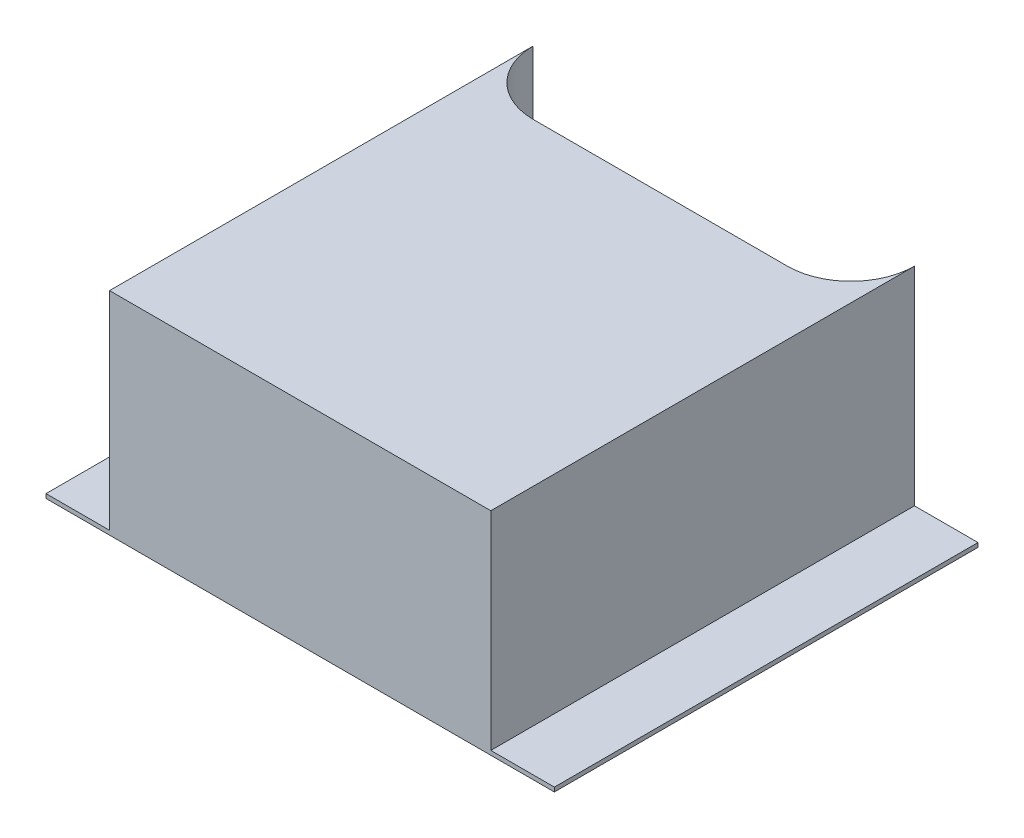
ISO-10303-21;
HEADER;
FILE_DESCRIPTION(('STEP AP214'),'2;1');
FILE_NAME('part.step','',(''),(''),'','','');
FILE_SCHEMA(('AUTOMOTIVE_DESIGN { 1 0 10303 214 1 1 1 1 }'));
ENDSEC;
DATA;
#1=APPLICATION_CONTEXT('core data for automotive mechanical design processes');
#2=APPLICATION_PROTOCOL_DEFINITION('international standard','automotive_design',2000,#1);
#3=PRODUCT_CONTEXT('',#1,'mechanical');
#4=PRODUCT('Part','Part','',(#3));
#5=PRODUCT_RELATED_PRODUCT_CATEGORY('part','',(#4));
#6=PRODUCT_DEFINITION_FORMATION('','',#4);
#7=PRODUCT_DEFINITION_CONTEXT('part definition',#1,'design');
#8=PRODUCT_DEFINITION('design','',#6,#7);
#9=PRODUCT_DEFINITION_SHAPE('','',#8);
#10=(LENGTH_UNIT() NAMED_UNIT(*) SI_UNIT(.MILLI.,.METRE.));
#11=(NAMED_UNIT(*) PLANE_ANGLE_UNIT() SI_UNIT($,.RADIAN.));
#12=(NAMED_UNIT(*) SI_UNIT($,.STERADIAN.) SOLID_ANGLE_UNIT());
#13=UNCERTAINTY_MEASURE_WITH_UNIT(LENGTH_MEASURE(1.E-05),#10,'distance_accuracy_value','');
#14=(GEOMETRIC_REPRESENTATION_CONTEXT(3) GLOBAL_UNCERTAINTY_ASSIGNED_CONTEXT((#13)) GLOBAL_UNIT_ASSIGNED_CONTEXT((#10,
#11,#12)) REPRESENTATION_CONTEXT('',''));
#15=CARTESIAN_POINT('',(0.,0.,0.));
#16=DIRECTION('',(0.,0.,1.));
#17=DIRECTION('',(1.,0.,0.));
#18=AXIS2_PLACEMENT_3D('',#15,#16,#17);
#19=CARTESIAN_POINT('',(1.72,-3.203513695928,1.6));
#20=DIRECTION('',(-1.,0.,0.));
#21=DIRECTION('',(0.,0.,1.));
#22=AXIS2_PLACEMENT_3D('',#19,#20,#21);
#23=PLANE('',#22);
#24=DIRECTION('',(0.,1.,0.));
#25=VECTOR('',#24,1.);
#26=CARTESIAN_POINT('',(1.72,-1.562049935181,-1.6));
#27=LINE('',#26,#25);
#28=CARTESIAN_POINT('',(1.72,0.01,-1.6));
#29=VERTEX_POINT('',#28);
#30=CARTESIAN_POINT('',(1.72,0.5,-1.6));
#31=VERTEX_POINT('',#30);
#32=EDGE_CURVE('E118',#29,#31,#27,.T.);
#33=ORIENTED_EDGE('',*,*,#32,.T.);
#34=DIRECTION('',(0.,0.,-1.));
#35=VECTOR('',#34,1.);
#36=CARTESIAN_POINT('',(1.72,0.5,-1.6));
#37=LINE('',#36,#35);
#38=CARTESIAN_POINT('',(1.72,0.5,-0.6));
#39=VERTEX_POINT('',#38);
#40=EDGE_CURVE('E98',#31,#39,#37,.F.);
#41=ORIENTED_EDGE('',*,*,#40,.T.);
#42=DIRECTION('',(0.,1.,0.));
#43=VECTOR('',#42,1.);
#44=CARTESIAN_POINT('',(1.72,-1.562049935181,-0.6));
#45=LINE('',#44,#43);
#46=CARTESIAN_POINT('',(1.72,0.01,-0.6));
#47=VERTEX_POINT('',#46);
#48=EDGE_CURVE('E169',#39,#47,#45,.F.);
#49=ORIENTED_EDGE('',*,*,#48,.T.);
#50=DIRECTION('',(0.,0.,1.));
#51=VECTOR('',#50,1.);
#52=CARTESIAN_POINT('',(1.72,0.01,0.));
#53=LINE('',#52,#51);
#54=EDGE_CURVE('E144',#29,#47,#53,.T.);
#55=ORIENTED_EDGE('',*,*,#54,.F.);
#56=EDGE_LOOP('',(#33,#41,#49,#55));
#57=FACE_BOUND('',#56,.T.);
#58=ADVANCED_FACE('F17',(#57),#23,.F.);
#59=CARTESIAN_POINT('',(0.,0.01,0.));
#60=DIRECTION('',(0.,1.,0.));
#61=DIRECTION('',(0.,0.,1.));
#62=AXIS2_PLACEMENT_3D('',#59,#60,#61);
#63=PLANE('',#62);
#64=DIRECTION('',(1.,0.,0.));
#65=VECTOR('',#64,1.);
#66=CARTESIAN_POINT('',(0.67,0.01,-1.6));
#67=LINE('',#66,#65);
#68=CARTESIAN_POINT('',(0.82,0.01,-1.6));
#69=VERTEX_POINT('',#68);
#70=CARTESIAN_POINT('',(0.67,0.01,-1.6));
#71=VERTEX_POINT('',#70);
#72=EDGE_CURVE('E161',#69,#71,#67,.F.);
#73=ORIENTED_EDGE('',*,*,#72,.T.);
#74=DIRECTION('',(0.,0.,-1.));
#75=VECTOR('',#74,1.);
#76=CARTESIAN_POINT('',(0.67,0.01,-0.6));
#77=LINE('',#76,#75);
#78=CARTESIAN_POINT('',(0.67,0.01,-0.6));
#79=VERTEX_POINT('',#78);
#80=EDGE_CURVE('E167',#71,#79,#77,.F.);
#81=ORIENTED_EDGE('',*,*,#80,.T.);
#82=DIRECTION('',(-1.,0.,0.));
#83=VECTOR('',#82,1.);
#84=CARTESIAN_POINT('',(1.87,0.01,-0.6));
#85=LINE('',#84,#83);
#86=CARTESIAN_POINT('',(0.82,0.01,-0.6));
#87=VERTEX_POINT('',#86);
#88=EDGE_CURVE('E200',#79,#87,#85,.F.);
#89=ORIENTED_EDGE('',*,*,#88,.T.);
#90=DIRECTION('',(0.,0.,-1.));
#91=VECTOR('',#90,1.);
#92=CARTESIAN_POINT('',(0.82,0.01,-1.6));
#93=LINE('',#92,#91);
#94=EDGE_CURVE('E158',#87,#69,#93,.T.);
#95=ORIENTED_EDGE('',*,*,#94,.T.);
#96=EDGE_LOOP('',(#73,#81,#89,#95));
#97=FACE_BOUND('',#96,.T.);
#98=ADVANCED_FACE('F258',(#97),#63,.T.);
#99=CARTESIAN_POINT('',(0.82,-3.203513695928,-1.6));
#100=DIRECTION('',(1.,0.,0.));
#101=DIRECTION('',(0.,0.,-1.));
#102=AXIS2_PLACEMENT_3D('',#99,#100,#101);
#103=PLANE('',#102);
#104=DIRECTION('',(0.,1.,0.));
#105=VECTOR('',#104,1.);
#106=CARTESIAN_POINT('',(0.82,-1.562049935181,-1.6));
#107=LINE('',#106,#105);
#108=CARTESIAN_POINT('',(0.82,0.5,-1.6));
#109=VERTEX_POINT('',#108);
#110=EDGE_CURVE('E125',#109,#69,#107,.F.);
#111=ORIENTED_EDGE('',*,*,#110,.T.);
#112=ORIENTED_EDGE('',*,*,#94,.F.);
#113=DIRECTION('',(0.,1.,0.));
#114=VECTOR('',#113,1.);
#115=CARTESIAN_POINT('',(0.82,-1.562049935181,-0.6));
#116=LINE('',#115,#114);
#117=CARTESIAN_POINT('',(0.82,0.5,-0.6));
#118=VERTEX_POINT('',#117);
#119=EDGE_CURVE('E195',#87,#118,#116,.T.);
#120=ORIENTED_EDGE('',*,*,#119,.T.);
#121=DIRECTION('',(0.,0.,-1.));
#122=VECTOR('',#121,1.);
#123=CARTESIAN_POINT('',(0.82,0.5,-1.6));
#124=LINE('',#123,#122);
#125=EDGE_CURVE('E153',#118,#109,#124,.T.);
#126=ORIENTED_EDGE('',*,*,#125,.T.);
#127=EDGE_LOOP('',(#111,#112,#120,#126));
#128=FACE_BOUND('',#127,.T.);
#129=ADVANCED_FACE('F261',(#128),#103,.F.);
#130=CARTESIAN_POINT('',(0.97,0.5,-1.6));
#131=DIRECTION('',(0.,-1.,0.));
#132=DIRECTION('',(0.,0.,-1.));
#133=AXIS2_PLACEMENT_3D('',#130,#131,#132);
#134=PLANE('',#133);
#135=ORIENTED_EDGE('',*,*,#125,.F.);
#136=DIRECTION('',(-1.,0.,0.));
#137=VECTOR('',#136,1.);
#138=CARTESIAN_POINT('',(1.87,0.5,-0.6));
#139=LINE('',#138,#137);
#140=EDGE_CURVE('E136',#118,#39,#139,.F.);
#141=ORIENTED_EDGE('',*,*,#140,.T.);
#142=ORIENTED_EDGE('',*,*,#40,.F.);
#143=CARTESIAN_POINT('',(1.57,0.5,-1.6));
#144=DIRECTION('',(0.,1.,0.));
#145=DIRECTION('',(0.,0.,1.));
#146=AXIS2_PLACEMENT_3D('',#143,#144,#145);
#147=CIRCLE('',#146,0.15);
#148=CARTESIAN_POINT('',(1.57,0.5,-1.45));
#149=VERTEX_POINT('',#148);
#150=EDGE_CURVE('E20',#31,#149,#147,.F.);
#151=ORIENTED_EDGE('',*,*,#150,.T.);
#152=DIRECTION('',(1.,0.,0.));
#153=VECTOR('',#152,1.);
#154=CARTESIAN_POINT('',(0.97,0.5,-1.45));
#155=LINE('',#154,#153);
#156=CARTESIAN_POINT('',(0.97,0.5,-1.45));
#157=VERTEX_POINT('',#156);
#158=EDGE_CURVE('E104',#149,#157,#155,.F.);
#159=ORIENTED_EDGE('',*,*,#158,.T.);
#160=CARTESIAN_POINT('',(0.97,0.5,-1.6));
#161=DIRECTION('',(0.,1.,0.));
#162=DIRECTION('',(0.,0.,1.));
#163=AXIS2_PLACEMENT_3D('',#160,#161,#162);
#164=CIRCLE('',#163,0.15);
#165=EDGE_CURVE('E123',#157,#109,#164,.F.);
#166=ORIENTED_EDGE('',*,*,#165,.T.);
#167=EDGE_LOOP('',(#135,#141,#142,#151,#159,#166));
#168=FACE_BOUND('',#167,.T.);
#169=ADVANCED_FACE('F114',(#168),#134,.F.);
#170=CARTESIAN_POINT('',(0.,0.01,0.));
#171=DIRECTION('',(0.,1.,0.));
#172=DIRECTION('',(0.,0.,1.));
#173=AXIS2_PLACEMENT_3D('',#170,#171,#172);
#174=PLANE('',#173);
#175=DIRECTION('',(1.,0.,0.));
#176=VECTOR('',#175,1.);
#177=CARTESIAN_POINT('',(1.72,0.01,-1.6));
#178=LINE('',#177,#176);
#179=CARTESIAN_POINT('',(1.87,0.01,-1.6));
#180=VERTEX_POINT('',#179);
#181=EDGE_CURVE('E141',#180,#29,#178,.F.);
#182=ORIENTED_EDGE('',*,*,#181,.T.);
#183=ORIENTED_EDGE('',*,*,#54,.T.);
#184=DIRECTION('',(-1.,0.,0.));
#185=VECTOR('',#184,1.);
#186=CARTESIAN_POINT('',(1.87,0.01,-0.6));
#187=LINE('',#186,#185);
#188=CARTESIAN_POINT('',(1.87,0.01,-0.6));
#189=VERTEX_POINT('',#188);
#190=EDGE_CURVE('E185',#47,#189,#187,.F.);
#191=ORIENTED_EDGE('',*,*,#190,.T.);
#192=DIRECTION('',(0.,0.,1.));
#193=VECTOR('',#192,1.);
#194=CARTESIAN_POINT('',(1.87,0.01,-1.6));
#195=LINE('',#194,#193);
#196=EDGE_CURVE('E147',#189,#180,#195,.F.);
#197=ORIENTED_EDGE('',*,*,#196,.T.);
#198=EDGE_LOOP('',(#182,#183,#191,#197));
#199=FACE_BOUND('',#198,.T.);
#200=ADVANCED_FACE('F266',(#199),#174,.T.);
#201=CARTESIAN_POINT('',(1.72,-1.562049935181,-1.6));
#202=DIRECTION('',(0.,0.,1.));
#203=DIRECTION('',(1.,0.,0.));
#204=AXIS2_PLACEMENT_3D('',#201,#202,#203);
#205=PLANE('',#204);
#206=DIRECTION('',(0.,1.,0.));
#207=VECTOR('',#206,1.);
#208=CARTESIAN_POINT('',(1.87,-1.562049935181,-1.6));
#209=LINE('',#208,#207);
#210=CARTESIAN_POINT('',(1.87,0.,-1.6));
#211=VERTEX_POINT('',#210);
#212=EDGE_CURVE('E133',#180,#211,#209,.F.);
#213=ORIENTED_EDGE('',*,*,#212,.T.);
#214=DIRECTION('',(1.,0.,0.));
#215=VECTOR('',#214,1.);
#216=CARTESIAN_POINT('',(0.,0.,-1.6));
#217=LINE('',#216,#215);
#218=CARTESIAN_POINT('',(1.72,0.,-1.6));
#219=VERTEX_POINT('',#218);
#220=EDGE_CURVE('E150',#211,#219,#217,.F.);
#221=ORIENTED_EDGE('',*,*,#220,.T.);
#222=DIRECTION('',(0.,1.,0.));
#223=VECTOR('',#222,1.);
#224=CARTESIAN_POINT('',(1.72,-1.562049935181,-1.6));
#225=LINE('',#224,#223);
#226=EDGE_CURVE('E112',#219,#29,#225,.T.);
#227=ORIENTED_EDGE('',*,*,#226,.T.);
#228=ORIENTED_EDGE('',*,*,#181,.F.);
#229=EDGE_LOOP('',(#213,#221,#227,#228));
#230=FACE_BOUND('',#229,.T.);
#231=ADVANCED_FACE('F268',(#230),#205,.F.);
#232=CARTESIAN_POINT('',(1.57,-1.562049935181,-1.6));
#233=DIRECTION('',(0.,1.,0.));
#234=DIRECTION('',(0.,0.,1.));
#235=AXIS2_PLACEMENT_3D('',#232,#233,#234);
#236=CYLINDRICAL_SURFACE('',#235,0.15);
#237=CARTESIAN_POINT('',(1.57,0.,-1.6));
#238=DIRECTION('',(0.,1.,0.));
#239=DIRECTION('',(0.,0.,1.));
#240=AXIS2_PLACEMENT_3D('',#237,#238,#239);
#241=CIRCLE('',#240,0.15);
#242=CARTESIAN_POINT('',(1.57,0.,-1.45));
#243=VERTEX_POINT('',#242);
#244=EDGE_CURVE('E122',#219,#243,#241,.F.);
#245=ORIENTED_EDGE('',*,*,#244,.T.);
#246=DIRECTION('',(0.,1.,0.));
#247=VECTOR('',#246,1.);
#248=CARTESIAN_POINT('',(1.57,-1.562049935181,-1.45));
#249=LINE('',#248,#247);
#250=EDGE_CURVE('E108',#243,#149,#249,.T.);
#251=ORIENTED_EDGE('',*,*,#250,.T.);
#252=ORIENTED_EDGE('',*,*,#150,.F.);
#253=ORIENTED_EDGE('',*,*,#32,.F.);
#254=ORIENTED_EDGE('',*,*,#226,.F.);
#255=EDGE_LOOP('',(#245,#251,#252,#253,#254));
#256=FACE_BOUND('',#255,.T.);
#257=ADVANCED_FACE('F120',(#256),#236,.F.);
#258=CARTESIAN_POINT('',(0.97,-1.562049935181,-1.45));
#259=DIRECTION('',(0.,0.,1.));
#260=DIRECTION('',(1.,0.,0.));
#261=AXIS2_PLACEMENT_3D('',#258,#259,#260);
#262=PLANE('',#261);
#263=DIRECTION('',(1.,0.,0.));
#264=VECTOR('',#263,1.);
#265=CARTESIAN_POINT('',(0.,0.,-1.45));
#266=LINE('',#265,#264);
#267=CARTESIAN_POINT('',(0.97,0.,-1.45));
#268=VERTEX_POINT('',#267);
#269=EDGE_CURVE('E211',#243,#268,#266,.F.);
#270=ORIENTED_EDGE('',*,*,#269,.T.);
#271=DIRECTION('',(0.,1.,0.));
#272=VECTOR('',#271,1.);
#273=CARTESIAN_POINT('',(0.97,-1.562049935181,-1.45));
#274=LINE('',#273,#272);
#275=EDGE_CURVE('E110',#268,#157,#274,.T.);
#276=ORIENTED_EDGE('',*,*,#275,.T.);
#277=ORIENTED_EDGE('',*,*,#158,.F.);
#278=ORIENTED_EDGE('',*,*,#250,.F.);
#279=EDGE_LOOP('',(#270,#276,#277,#278));
#280=FACE_BOUND('',#279,.T.);
#281=ADVANCED_FACE('F106',(#280),#262,.F.);
#282=CARTESIAN_POINT('',(0.97,-1.562049935181,-1.6));
#283=DIRECTION('',(0.,1.,0.));
#284=DIRECTION('',(0.,0.,1.));
#285=AXIS2_PLACEMENT_3D('',#282,#283,#284);
#286=CYLINDRICAL_SURFACE('',#285,0.15);
#287=CARTESIAN_POINT('',(0.97,0.,-1.6));
#288=DIRECTION('',(0.,1.,0.));
#289=DIRECTION('',(0.,0.,1.));
#290=AXIS2_PLACEMENT_3D('',#287,#288,#289);
#291=CIRCLE('',#290,0.15);
#292=CARTESIAN_POINT('',(0.82,0.,-1.6));
#293=VERTEX_POINT('',#292);
#294=EDGE_CURVE('E207',#268,#293,#291,.F.);
#295=ORIENTED_EDGE('',*,*,#294,.T.);
#296=DIRECTION('',(0.,1.,0.));
#297=VECTOR('',#296,1.);
#298=CARTESIAN_POINT('',(0.82,-1.562049935181,-1.6));
#299=LINE('',#298,#297);
#300=EDGE_CURVE('E164',#293,#69,#299,.T.);
#301=ORIENTED_EDGE('',*,*,#300,.T.);
#302=ORIENTED_EDGE('',*,*,#110,.F.);
#303=ORIENTED_EDGE('',*,*,#165,.F.);
#304=ORIENTED_EDGE('',*,*,#275,.F.);
#305=EDGE_LOOP('',(#295,#301,#302,#303,#304));
#306=FACE_BOUND('',#305,.T.);
#307=ADVANCED_FACE('F263',(#306),#286,.F.);
#308=CARTESIAN_POINT('',(0.67,-1.562049935181,-1.6));
#309=DIRECTION('',(0.,0.,1.));
#310=DIRECTION('',(1.,0.,0.));
#311=AXIS2_PLACEMENT_3D('',#308,#309,#310);
#312=PLANE('',#311);
#313=ORIENTED_EDGE('',*,*,#300,.F.);
#314=DIRECTION('',(1.,0.,0.));
#315=VECTOR('',#314,1.);
#316=CARTESIAN_POINT('',(0.,0.,-1.6));
#317=LINE('',#316,#315);
#318=CARTESIAN_POINT('',(0.67,0.,-1.6));
#319=VERTEX_POINT('',#318);
#320=EDGE_CURVE('E210',#293,#319,#317,.F.);
#321=ORIENTED_EDGE('',*,*,#320,.T.);
#322=DIRECTION('',(0.,1.,0.));
#323=VECTOR('',#322,1.);
#324=CARTESIAN_POINT('',(0.67,-1.562049935181,-1.6));
#325=LINE('',#324,#323);
#326=EDGE_CURVE('E163',#319,#71,#325,.T.);
#327=ORIENTED_EDGE('',*,*,#326,.T.);
#328=ORIENTED_EDGE('',*,*,#72,.F.);
#329=EDGE_LOOP('',(#313,#321,#327,#328));
#330=FACE_BOUND('',#329,.T.);
#331=ADVANCED_FACE('F237',(#330),#312,.F.);
#332=CARTESIAN_POINT('',(0.67,-1.562049935181,-0.6));
#333=DIRECTION('',(1.,0.,0.));
#334=DIRECTION('',(0.,0.,-1.));
#335=AXIS2_PLACEMENT_3D('',#332,#333,#334);
#336=PLANE('',#335);
#337=ORIENTED_EDGE('',*,*,#326,.F.);
#338=DIRECTION('',(0.,0.,1.));
#339=VECTOR('',#338,1.);
#340=CARTESIAN_POINT('',(0.67,0.,0.));
#341=LINE('',#340,#339);
#342=CARTESIAN_POINT('',(0.67,0.,-0.6));
#343=VERTEX_POINT('',#342);
#344=EDGE_CURVE('E227',#319,#343,#341,.T.);
#345=ORIENTED_EDGE('',*,*,#344,.T.);
#346=DIRECTION('',(0.,1.,0.));
#347=VECTOR('',#346,1.);
#348=CARTESIAN_POINT('',(0.67,-1.562049935181,-0.6));
#349=LINE('',#348,#347);
#350=EDGE_CURVE('E187',#343,#79,#349,.T.);
#351=ORIENTED_EDGE('',*,*,#350,.T.);
#352=ORIENTED_EDGE('',*,*,#80,.F.);
#353=EDGE_LOOP('',(#337,#345,#351,#352));
#354=FACE_BOUND('',#353,.T.);
#355=ADVANCED_FACE('F242',(#354),#336,.F.);
#356=CARTESIAN_POINT('',(1.87,-1.562049935181,-0.6));
#357=DIRECTION('',(0.,0.,-1.));
#358=DIRECTION('',(-1.,0.,0.));
#359=AXIS2_PLACEMENT_3D('',#356,#357,#358);
#360=PLANE('',#359);
#361=ORIENTED_EDGE('',*,*,#119,.F.);
#362=ORIENTED_EDGE('',*,*,#88,.F.);
#363=ORIENTED_EDGE('',*,*,#350,.F.);
#364=DIRECTION('',(1.,0.,0.));
#365=VECTOR('',#364,1.);
#366=CARTESIAN_POINT('',(0.,0.,-0.6));
#367=LINE('',#366,#365);
#368=CARTESIAN_POINT('',(1.87,0.,-0.6));
#369=VERTEX_POINT('',#368);
#370=EDGE_CURVE('E26',#343,#369,#367,.T.);
#371=ORIENTED_EDGE('',*,*,#370,.T.);
#372=DIRECTION('',(0.,1.,0.));
#373=VECTOR('',#372,1.);
#374=CARTESIAN_POINT('',(1.87,-1.562049935181,-0.6));
#375=LINE('',#374,#373);
#376=EDGE_CURVE('E34',#369,#189,#375,.T.);
#377=ORIENTED_EDGE('',*,*,#376,.T.);
#378=ORIENTED_EDGE('',*,*,#190,.F.);
#379=ORIENTED_EDGE('',*,*,#48,.F.);
#380=ORIENTED_EDGE('',*,*,#140,.F.);
#381=EDGE_LOOP('',(#361,#362,#363,#371,#377,#378,#379,#380));
#382=FACE_BOUND('',#381,.T.);
#383=ADVANCED_FACE('F253',(#382),#360,.F.);
#384=CARTESIAN_POINT('',(1.87,-1.562049935181,-1.6));
#385=DIRECTION('',(-1.,0.,0.));
#386=DIRECTION('',(0.,0.,1.));
#387=AXIS2_PLACEMENT_3D('',#384,#385,#386);
#388=PLANE('',#387);
#389=ORIENTED_EDGE('',*,*,#376,.F.);
#390=DIRECTION('',(0.,0.,1.));
#391=VECTOR('',#390,1.);
#392=CARTESIAN_POINT('',(1.87,0.,0.));
#393=LINE('',#392,#391);
#394=EDGE_CURVE('E11',#369,#211,#393,.F.);
#395=ORIENTED_EDGE('',*,*,#394,.T.);
#396=ORIENTED_EDGE('',*,*,#212,.F.);
#397=ORIENTED_EDGE('',*,*,#196,.F.);
#398=EDGE_LOOP('',(#389,#395,#396,#397));
#399=FACE_BOUND('',#398,.T.);
#400=ADVANCED_FACE('F279',(#399),#388,.F.);
#401=CARTESIAN_POINT('',(0.,0.,0.));
#402=DIRECTION('',(0.,1.,0.));
#403=DIRECTION('',(0.,0.,1.));
#404=AXIS2_PLACEMENT_3D('',#401,#402,#403);
#405=PLANE('',#404);
#406=ORIENTED_EDGE('',*,*,#370,.F.);
#407=ORIENTED_EDGE('',*,*,#344,.F.);
#408=ORIENTED_EDGE('',*,*,#320,.F.);
#409=ORIENTED_EDGE('',*,*,#294,.F.);
#410=ORIENTED_EDGE('',*,*,#269,.F.);
#411=ORIENTED_EDGE('',*,*,#244,.F.);
#412=ORIENTED_EDGE('',*,*,#220,.F.);
#413=ORIENTED_EDGE('',*,*,#394,.F.);
#414=EDGE_LOOP('',(#406,#407,#408,#409,#410,#411,#412,#413));
#415=FACE_BOUND('',#414,.T.);
#416=ADVANCED_FACE('F245',(#415),#405,.F.);
#417=CLOSED_SHELL('',(#58,#98,#129,#169,#200,#231,#257,#281,#307,#331,#355,#383,#400,#416));
#418=MANIFOLD_SOLID_BREP('B1',#417);
#419=ADVANCED_BREP_SHAPE_REPRESENTATION('',(#18,#418),#14);
#420=SHAPE_DEFINITION_REPRESENTATION(#9,#419);
ENDSEC;
END-ISO-10303-21;
